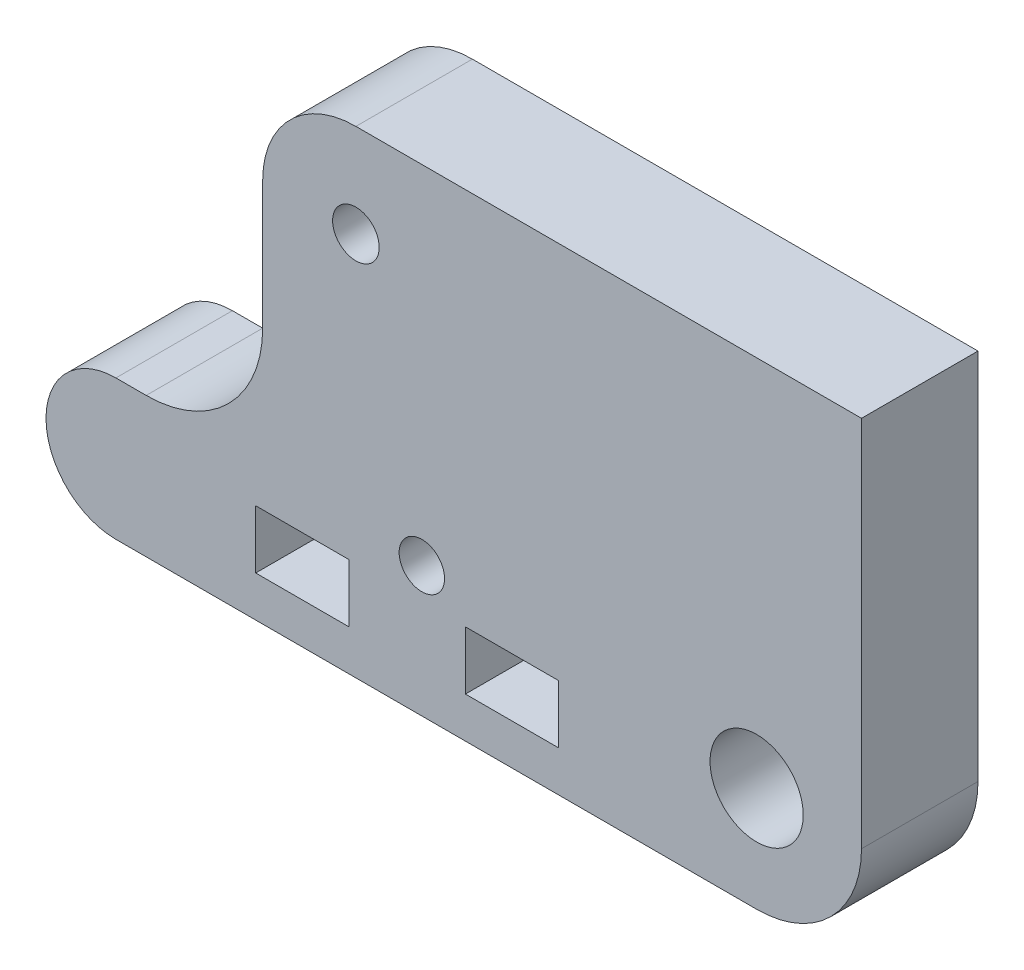
ISO-10303-21;
HEADER;
FILE_DESCRIPTION(('STEP AP214'),'2;1');
FILE_NAME('part.step','',(''),(''),'','','');
FILE_SCHEMA(('AUTOMOTIVE_DESIGN { 1 0 10303 214 1 1 1 1 }'));
ENDSEC;
DATA;
#1=APPLICATION_CONTEXT('core data for automotive mechanical design processes');
#2=APPLICATION_PROTOCOL_DEFINITION('international standard','automotive_design',2000,#1);
#3=PRODUCT_CONTEXT('',#1,'mechanical');
#4=PRODUCT('Part','Part','',(#3));
#5=PRODUCT_RELATED_PRODUCT_CATEGORY('part','',(#4));
#6=PRODUCT_DEFINITION_FORMATION('','',#4);
#7=PRODUCT_DEFINITION_CONTEXT('part definition',#1,'design');
#8=PRODUCT_DEFINITION('design','',#6,#7);
#9=PRODUCT_DEFINITION_SHAPE('','',#8);
#10=(LENGTH_UNIT() NAMED_UNIT(*) SI_UNIT(.MILLI.,.METRE.));
#11=(NAMED_UNIT(*) PLANE_ANGLE_UNIT() SI_UNIT($,.RADIAN.));
#12=(NAMED_UNIT(*) SI_UNIT($,.STERADIAN.) SOLID_ANGLE_UNIT());
#13=UNCERTAINTY_MEASURE_WITH_UNIT(LENGTH_MEASURE(1.E-05),#10,'distance_accuracy_value','');
#14=(GEOMETRIC_REPRESENTATION_CONTEXT(3) GLOBAL_UNCERTAINTY_ASSIGNED_CONTEXT((#13)) GLOBAL_UNIT_ASSIGNED_CONTEXT((#10,
#11,#12)) REPRESENTATION_CONTEXT('',''));
#15=CARTESIAN_POINT('',(0.,0.,0.));
#16=DIRECTION('',(0.,0.,1.));
#17=DIRECTION('',(1.,0.,0.));
#18=AXIS2_PLACEMENT_3D('',#15,#16,#17);
#19=CARTESIAN_POINT('',(0.,8.5,10.));
#20=DIRECTION('',(0.,1.,0.));
#21=DIRECTION('',(0.,0.,1.));
#22=AXIS2_PLACEMENT_3D('',#19,#20,#21);
#23=PLANE('',#22);
#24=DIRECTION('',(1.,0.,0.));
#25=VECTOR('',#24,1.);
#26=CARTESIAN_POINT('',(0.,8.5,0.));
#27=LINE('',#26,#25);
#28=CARTESIAN_POINT('',(2.5,8.5,0.));
#29=VERTEX_POINT('',#28);
#30=CARTESIAN_POINT('',(10.5,8.5,0.));
#31=VERTEX_POINT('',#30);
#32=EDGE_CURVE('E233',#29,#31,#27,.T.);
#33=ORIENTED_EDGE('',*,*,#32,.T.);
#34=DIRECTION('',(0.,0.,-1.));
#35=VECTOR('',#34,1.);
#36=CARTESIAN_POINT('',(10.5,8.5,10.));
#37=LINE('',#36,#35);
#38=CARTESIAN_POINT('',(10.5,8.5,10.));
#39=VERTEX_POINT('',#38);
#40=EDGE_CURVE('E11',#39,#31,#37,.T.);
#41=ORIENTED_EDGE('',*,*,#40,.F.);
#42=DIRECTION('',(1.,0.,0.));
#43=VECTOR('',#42,1.);
#44=CARTESIAN_POINT('',(0.,8.5,10.));
#45=LINE('',#44,#43);
#46=CARTESIAN_POINT('',(2.5,8.5,10.));
#47=VERTEX_POINT('',#46);
#48=EDGE_CURVE('E169',#47,#39,#45,.T.);
#49=ORIENTED_EDGE('',*,*,#48,.F.);
#50=DIRECTION('',(0.,0.,-1.));
#51=VECTOR('',#50,1.);
#52=CARTESIAN_POINT('',(2.5,8.5,10.));
#53=LINE('',#52,#51);
#54=EDGE_CURVE('E54',#47,#29,#53,.T.);
#55=ORIENTED_EDGE('',*,*,#54,.T.);
#56=EDGE_LOOP('',(#33,#41,#49,#55));
#57=FACE_BOUND('',#56,.T.);
#58=ADVANCED_FACE('F35',(#57),#23,.F.);
#59=CARTESIAN_POINT('',(10.5,0.,10.));
#60=DIRECTION('',(1.,0.,0.));
#61=DIRECTION('',(0.,0.,-1.));
#62=AXIS2_PLACEMENT_3D('',#59,#60,#61);
#63=PLANE('',#62);
#64=DIRECTION('',(0.,-1.,0.));
#65=VECTOR('',#64,1.);
#66=CARTESIAN_POINT('',(10.5,0.,0.));
#67=LINE('',#66,#65);
#68=CARTESIAN_POINT('',(10.5,3.5,0.));
#69=VERTEX_POINT('',#68);
#70=EDGE_CURVE('E175',#31,#69,#67,.T.);
#71=ORIENTED_EDGE('',*,*,#70,.T.);
#72=DIRECTION('',(0.,0.,-1.));
#73=VECTOR('',#72,1.);
#74=CARTESIAN_POINT('',(10.5,3.5,10.));
#75=LINE('',#74,#73);
#76=CARTESIAN_POINT('',(10.5,3.5,10.));
#77=VERTEX_POINT('',#76);
#78=EDGE_CURVE('E45',#77,#69,#75,.T.);
#79=ORIENTED_EDGE('',*,*,#78,.F.);
#80=DIRECTION('',(0.,-1.,0.));
#81=VECTOR('',#80,1.);
#82=CARTESIAN_POINT('',(10.5,0.,10.));
#83=LINE('',#82,#81);
#84=EDGE_CURVE('E163',#39,#77,#83,.T.);
#85=ORIENTED_EDGE('',*,*,#84,.F.);
#86=ORIENTED_EDGE('',*,*,#40,.T.);
#87=EDGE_LOOP('',(#71,#79,#85,#86));
#88=FACE_BOUND('',#87,.T.);
#89=ADVANCED_FACE('F174',(#88),#63,.F.);
#90=CARTESIAN_POINT('',(0.,3.5,10.));
#91=DIRECTION('',(0.,1.,0.));
#92=DIRECTION('',(0.,0.,1.));
#93=AXIS2_PLACEMENT_3D('',#90,#91,#92);
#94=PLANE('',#93);
#95=DIRECTION('',(1.,0.,0.));
#96=VECTOR('',#95,1.);
#97=CARTESIAN_POINT('',(0.,3.5,0.));
#98=LINE('',#97,#96);
#99=CARTESIAN_POINT('',(2.5,3.5,0.));
#100=VERTEX_POINT('',#99);
#101=EDGE_CURVE('E236',#100,#69,#98,.T.);
#102=ORIENTED_EDGE('',*,*,#101,.F.);
#103=DIRECTION('',(0.,0.,-1.));
#104=VECTOR('',#103,1.);
#105=CARTESIAN_POINT('',(2.5,3.5,10.));
#106=LINE('',#105,#104);
#107=CARTESIAN_POINT('',(2.5,3.5,10.));
#108=VERTEX_POINT('',#107);
#109=EDGE_CURVE('E107',#108,#100,#106,.T.);
#110=ORIENTED_EDGE('',*,*,#109,.F.);
#111=DIRECTION('',(1.,0.,0.));
#112=VECTOR('',#111,1.);
#113=CARTESIAN_POINT('',(0.,3.5,10.));
#114=LINE('',#113,#112);
#115=EDGE_CURVE('E168',#108,#77,#114,.T.);
#116=ORIENTED_EDGE('',*,*,#115,.T.);
#117=ORIENTED_EDGE('',*,*,#78,.T.);
#118=EDGE_LOOP('',(#102,#110,#116,#117));
#119=FACE_BOUND('',#118,.T.);
#120=ADVANCED_FACE('F179',(#119),#94,.T.);
#121=CARTESIAN_POINT('',(0.,8.5,10.));
#122=DIRECTION('',(0.,1.,0.));
#123=DIRECTION('',(0.,0.,1.));
#124=AXIS2_PLACEMENT_3D('',#121,#122,#123);
#125=PLANE('',#124);
#126=DIRECTION('',(1.,0.,0.));
#127=VECTOR('',#126,1.);
#128=CARTESIAN_POINT('',(0.,8.5,0.));
#129=LINE('',#128,#127);
#130=CARTESIAN_POINT('',(-15.5,8.5,0.));
#131=VERTEX_POINT('',#130);
#132=CARTESIAN_POINT('',(-7.5,8.5,0.));
#133=VERTEX_POINT('',#132);
#134=EDGE_CURVE('E221',#131,#133,#129,.T.);
#135=ORIENTED_EDGE('',*,*,#134,.T.);
#136=DIRECTION('',(0.,0.,-1.));
#137=VECTOR('',#136,1.);
#138=CARTESIAN_POINT('',(-7.5,8.5,10.));
#139=LINE('',#138,#137);
#140=CARTESIAN_POINT('',(-7.5,8.5,10.));
#141=VERTEX_POINT('',#140);
#142=EDGE_CURVE('E242',#141,#133,#139,.T.);
#143=ORIENTED_EDGE('',*,*,#142,.F.);
#144=DIRECTION('',(1.,0.,0.));
#145=VECTOR('',#144,1.);
#146=CARTESIAN_POINT('',(0.,8.5,10.));
#147=LINE('',#146,#145);
#148=CARTESIAN_POINT('',(-15.5,8.5,10.));
#149=VERTEX_POINT('',#148);
#150=EDGE_CURVE('E319',#149,#141,#147,.T.);
#151=ORIENTED_EDGE('',*,*,#150,.F.);
#152=DIRECTION('',(0.,0.,-1.));
#153=VECTOR('',#152,1.);
#154=CARTESIAN_POINT('',(-15.5,8.5,10.));
#155=LINE('',#154,#153);
#156=EDGE_CURVE('E244',#149,#131,#155,.T.);
#157=ORIENTED_EDGE('',*,*,#156,.T.);
#158=EDGE_LOOP('',(#135,#143,#151,#157));
#159=FACE_BOUND('',#158,.T.);
#160=ADVANCED_FACE('F345',(#159),#125,.F.);
#161=CARTESIAN_POINT('',(-7.5,0.,10.));
#162=DIRECTION('',(1.,0.,0.));
#163=DIRECTION('',(0.,0.,-1.));
#164=AXIS2_PLACEMENT_3D('',#161,#162,#163);
#165=PLANE('',#164);
#166=DIRECTION('',(0.,-1.,0.));
#167=VECTOR('',#166,1.);
#168=CARTESIAN_POINT('',(-7.5,0.,0.));
#169=LINE('',#168,#167);
#170=CARTESIAN_POINT('',(-7.5,3.5,0.));
#171=VERTEX_POINT('',#170);
#172=EDGE_CURVE('E224',#133,#171,#169,.T.);
#173=ORIENTED_EDGE('',*,*,#172,.T.);
#174=DIRECTION('',(0.,0.,-1.));
#175=VECTOR('',#174,1.);
#176=CARTESIAN_POINT('',(-7.5,3.5,10.));
#177=LINE('',#176,#175);
#178=CARTESIAN_POINT('',(-7.5,3.5,10.));
#179=VERTEX_POINT('',#178);
#180=EDGE_CURVE('E248',#179,#171,#177,.T.);
#181=ORIENTED_EDGE('',*,*,#180,.F.);
#182=DIRECTION('',(0.,-1.,0.));
#183=VECTOR('',#182,1.);
#184=CARTESIAN_POINT('',(-7.5,0.,10.));
#185=LINE('',#184,#183);
#186=EDGE_CURVE('E322',#141,#179,#185,.T.);
#187=ORIENTED_EDGE('',*,*,#186,.F.);
#188=ORIENTED_EDGE('',*,*,#142,.T.);
#189=EDGE_LOOP('',(#173,#181,#187,#188));
#190=FACE_BOUND('',#189,.T.);
#191=ADVANCED_FACE('F347',(#190),#165,.F.);
#192=CARTESIAN_POINT('',(0.,3.5,10.));
#193=DIRECTION('',(0.,1.,0.));
#194=DIRECTION('',(0.,0.,1.));
#195=AXIS2_PLACEMENT_3D('',#192,#193,#194);
#196=PLANE('',#195);
#197=DIRECTION('',(1.,0.,0.));
#198=VECTOR('',#197,1.);
#199=CARTESIAN_POINT('',(0.,3.5,0.));
#200=LINE('',#199,#198);
#201=CARTESIAN_POINT('',(-15.5,3.5,0.));
#202=VERTEX_POINT('',#201);
#203=EDGE_CURVE('E227',#202,#171,#200,.T.);
#204=ORIENTED_EDGE('',*,*,#203,.F.);
#205=DIRECTION('',(0.,0.,-1.));
#206=VECTOR('',#205,1.);
#207=CARTESIAN_POINT('',(-15.5,3.5,10.));
#208=LINE('',#207,#206);
#209=CARTESIAN_POINT('',(-15.5,3.5,10.));
#210=VERTEX_POINT('',#209);
#211=EDGE_CURVE('E246',#210,#202,#208,.T.);
#212=ORIENTED_EDGE('',*,*,#211,.F.);
#213=DIRECTION('',(1.,0.,0.));
#214=VECTOR('',#213,1.);
#215=CARTESIAN_POINT('',(0.,3.5,10.));
#216=LINE('',#215,#214);
#217=EDGE_CURVE('E324',#210,#179,#216,.T.);
#218=ORIENTED_EDGE('',*,*,#217,.T.);
#219=ORIENTED_EDGE('',*,*,#180,.T.);
#220=EDGE_LOOP('',(#204,#212,#218,#219));
#221=FACE_BOUND('',#220,.T.);
#222=ADVANCED_FACE('F340',(#221),#196,.T.);
#223=CARTESIAN_POINT('',(27.5,9.,10.));
#224=DIRECTION('',(0.,0.,-1.));
#225=DIRECTION('',(-1.,0.,0.));
#226=AXIS2_PLACEMENT_3D('',#223,#224,#225);
#227=CYLINDRICAL_SURFACE('',#226,9.);
#228=CARTESIAN_POINT('',(27.5,9.,0.));
#229=DIRECTION('',(0.,0.,1.));
#230=DIRECTION('',(1.,0.,0.));
#231=AXIS2_PLACEMENT_3D('',#228,#229,#230);
#232=CIRCLE('',#231,9.);
#233=CARTESIAN_POINT('',(27.5,0.,0.));
#234=VERTEX_POINT('',#233);
#235=CARTESIAN_POINT('',(36.5,9.,0.));
#236=VERTEX_POINT('',#235);
#237=EDGE_CURVE('E186',#234,#236,#232,.T.);
#238=ORIENTED_EDGE('',*,*,#237,.T.);
#239=DIRECTION('',(0.,0.,-1.));
#240=VECTOR('',#239,1.);
#241=CARTESIAN_POINT('',(36.5,9.,10.));
#242=LINE('',#241,#240);
#243=CARTESIAN_POINT('',(36.5,9.,10.));
#244=VERTEX_POINT('',#243);
#245=EDGE_CURVE('E39',#244,#236,#242,.T.);
#246=ORIENTED_EDGE('',*,*,#245,.F.);
#247=CARTESIAN_POINT('',(27.5,9.,10.));
#248=DIRECTION('',(0.,0.,1.));
#249=DIRECTION('',(1.,0.,0.));
#250=AXIS2_PLACEMENT_3D('',#247,#248,#249);
#251=CIRCLE('',#250,9.);
#252=CARTESIAN_POINT('',(27.5,0.,10.));
#253=VERTEX_POINT('',#252);
#254=EDGE_CURVE('E120',#253,#244,#251,.T.);
#255=ORIENTED_EDGE('',*,*,#254,.F.);
#256=DIRECTION('',(0.,0.,-1.));
#257=VECTOR('',#256,1.);
#258=CARTESIAN_POINT('',(27.5,0.,10.));
#259=LINE('',#258,#257);
#260=EDGE_CURVE('E182',#253,#234,#259,.T.);
#261=ORIENTED_EDGE('',*,*,#260,.T.);
#262=EDGE_LOOP('',(#238,#246,#255,#261));
#263=FACE_BOUND('',#262,.T.);
#264=ADVANCED_FACE('F37',(#263),#227,.T.);
#265=CARTESIAN_POINT('',(36.5,0.,10.));
#266=DIRECTION('',(1.,0.,0.));
#267=DIRECTION('',(0.,0.,-1.));
#268=AXIS2_PLACEMENT_3D('',#265,#266,#267);
#269=PLANE('',#268);
#270=DIRECTION('',(0.,-1.,0.));
#271=VECTOR('',#270,1.);
#272=CARTESIAN_POINT('',(36.5,0.,0.));
#273=LINE('',#272,#271);
#274=CARTESIAN_POINT('',(36.5,41.,0.));
#275=VERTEX_POINT('',#274);
#276=EDGE_CURVE('E189',#275,#236,#273,.T.);
#277=ORIENTED_EDGE('',*,*,#276,.F.);
#278=DIRECTION('',(0.,0.,-1.));
#279=VECTOR('',#278,1.);
#280=CARTESIAN_POINT('',(36.5,41.,10.));
#281=LINE('',#280,#279);
#282=CARTESIAN_POINT('',(36.5,41.,10.));
#283=VERTEX_POINT('',#282);
#284=EDGE_CURVE('E265',#283,#275,#281,.T.);
#285=ORIENTED_EDGE('',*,*,#284,.F.);
#286=DIRECTION('',(0.,-1.,0.));
#287=VECTOR('',#286,1.);
#288=CARTESIAN_POINT('',(36.5,0.,10.));
#289=LINE('',#288,#287);
#290=EDGE_CURVE('E273',#283,#244,#289,.T.);
#291=ORIENTED_EDGE('',*,*,#290,.T.);
#292=ORIENTED_EDGE('',*,*,#245,.T.);
#293=EDGE_LOOP('',(#277,#285,#291,#292));
#294=FACE_BOUND('',#293,.T.);
#295=ADVANCED_FACE('F272',(#294),#269,.T.);
#296=CARTESIAN_POINT('',(0.,41.,10.));
#297=DIRECTION('',(0.,1.,0.));
#298=DIRECTION('',(0.,0.,1.));
#299=AXIS2_PLACEMENT_3D('',#296,#297,#298);
#300=PLANE('',#299);
#301=DIRECTION('',(1.,0.,0.));
#302=VECTOR('',#301,1.);
#303=CARTESIAN_POINT('',(0.,41.,0.));
#304=LINE('',#303,#302);
#305=CARTESIAN_POINT('',(-6.9,41.,0.));
#306=VERTEX_POINT('',#305);
#307=EDGE_CURVE('E192',#306,#275,#304,.T.);
#308=ORIENTED_EDGE('',*,*,#307,.F.);
#309=DIRECTION('',(0.,0.,-1.));
#310=VECTOR('',#309,1.);
#311=CARTESIAN_POINT('',(-6.9,41.,10.));
#312=LINE('',#311,#310);
#313=CARTESIAN_POINT('',(-6.9,41.,10.));
#314=VERTEX_POINT('',#313);
#315=EDGE_CURVE('E264',#314,#306,#312,.T.);
#316=ORIENTED_EDGE('',*,*,#315,.F.);
#317=DIRECTION('',(1.,0.,0.));
#318=VECTOR('',#317,1.);
#319=CARTESIAN_POINT('',(0.,41.,10.));
#320=LINE('',#319,#318);
#321=EDGE_CURVE('E284',#314,#283,#320,.T.);
#322=ORIENTED_EDGE('',*,*,#321,.T.);
#323=ORIENTED_EDGE('',*,*,#284,.T.);
#324=EDGE_LOOP('',(#308,#316,#322,#323));
#325=FACE_BOUND('',#324,.T.);
#326=ADVANCED_FACE('F282',(#325),#300,.T.);
#327=CARTESIAN_POINT('',(-6.9,33.,10.));
#328=DIRECTION('',(0.,0.,-1.));
#329=DIRECTION('',(-1.,0.,0.));
#330=AXIS2_PLACEMENT_3D('',#327,#328,#329);
#331=CYLINDRICAL_SURFACE('',#330,8.);
#332=CARTESIAN_POINT('',(-6.9,33.,0.));
#333=DIRECTION('',(0.,0.,1.));
#334=DIRECTION('',(1.,0.,0.));
#335=AXIS2_PLACEMENT_3D('',#332,#333,#334);
#336=CIRCLE('',#335,8.);
#337=CARTESIAN_POINT('',(-14.9,33.,0.));
#338=VERTEX_POINT('',#337);
#339=EDGE_CURVE('E195',#338,#306,#336,.F.);
#340=ORIENTED_EDGE('',*,*,#339,.F.);
#341=DIRECTION('',(0.,0.,-1.));
#342=VECTOR('',#341,1.);
#343=CARTESIAN_POINT('',(-14.9,33.,10.));
#344=LINE('',#343,#342);
#345=CARTESIAN_POINT('',(-14.9,33.,10.));
#346=VERTEX_POINT('',#345);
#347=EDGE_CURVE('E262',#346,#338,#344,.T.);
#348=ORIENTED_EDGE('',*,*,#347,.F.);
#349=CARTESIAN_POINT('',(-6.9,33.,10.));
#350=DIRECTION('',(0.,0.,1.));
#351=DIRECTION('',(1.,0.,0.));
#352=AXIS2_PLACEMENT_3D('',#349,#350,#351);
#353=CIRCLE('',#352,8.);
#354=EDGE_CURVE('E290',#346,#314,#353,.F.);
#355=ORIENTED_EDGE('',*,*,#354,.T.);
#356=ORIENTED_EDGE('',*,*,#315,.T.);
#357=EDGE_LOOP('',(#340,#348,#355,#356));
#358=FACE_BOUND('',#357,.T.);
#359=ADVANCED_FACE('F293',(#358),#331,.T.);
#360=CARTESIAN_POINT('',(-14.9,0.,10.));
#361=DIRECTION('',(-1.,0.,0.));
#362=DIRECTION('',(0.,-1.,0.));
#363=AXIS2_PLACEMENT_3D('',#360,#361,#362);
#364=PLANE('',#363);
#365=DIRECTION('',(0.,1.,0.));
#366=VECTOR('',#365,1.);
#367=CARTESIAN_POINT('',(-14.9,0.,0.));
#368=LINE('',#367,#366);
#369=CARTESIAN_POINT('',(-14.9,22.0000000000001,0.));
#370=VERTEX_POINT('',#369);
#371=EDGE_CURVE('E198',#370,#338,#368,.T.);
#372=ORIENTED_EDGE('',*,*,#371,.F.);
#373=DIRECTION('',(0.,0.,-1.));
#374=VECTOR('',#373,1.);
#375=CARTESIAN_POINT('',(-14.9,22.0000000000001,10.));
#376=LINE('',#375,#374);
#377=CARTESIAN_POINT('',(-14.9,22.0000000000001,10.));
#378=VERTEX_POINT('',#377);
#379=EDGE_CURVE('E260',#378,#370,#376,.T.);
#380=ORIENTED_EDGE('',*,*,#379,.F.);
#381=DIRECTION('',(0.,1.,0.));
#382=VECTOR('',#381,1.);
#383=CARTESIAN_POINT('',(-14.9,0.,10.));
#384=LINE('',#383,#382);
#385=EDGE_CURVE('E294',#378,#346,#384,.T.);
#386=ORIENTED_EDGE('',*,*,#385,.T.);
#387=ORIENTED_EDGE('',*,*,#347,.T.);
#388=EDGE_LOOP('',(#372,#380,#386,#387));
#389=FACE_BOUND('',#388,.T.);
#390=ADVANCED_FACE('F390',(#389),#364,.T.);
#391=CARTESIAN_POINT('',(-24.9,22.,10.));
#392=DIRECTION('',(0.,0.,-1.));
#393=DIRECTION('',(-1.,0.,0.));
#394=AXIS2_PLACEMENT_3D('',#391,#392,#393);
#395=CYLINDRICAL_SURFACE('',#394,10.);
#396=CARTESIAN_POINT('',(-24.9,22.,0.));
#397=DIRECTION('',(0.,0.,1.));
#398=DIRECTION('',(1.,0.,0.));
#399=AXIS2_PLACEMENT_3D('',#396,#397,#398);
#400=CIRCLE('',#399,10.);
#401=CARTESIAN_POINT('',(-24.9000000000001,12.,0.));
#402=VERTEX_POINT('',#401);
#403=EDGE_CURVE('E201',#402,#370,#400,.T.);
#404=ORIENTED_EDGE('',*,*,#403,.F.);
#405=DIRECTION('',(0.,0.,-1.));
#406=VECTOR('',#405,1.);
#407=CARTESIAN_POINT('',(-24.9000000000001,12.,10.));
#408=LINE('',#407,#406);
#409=CARTESIAN_POINT('',(-24.9000000000001,12.,10.));
#410=VERTEX_POINT('',#409);
#411=EDGE_CURVE('E258',#410,#402,#408,.T.);
#412=ORIENTED_EDGE('',*,*,#411,.F.);
#413=CARTESIAN_POINT('',(-24.9,22.,10.));
#414=DIRECTION('',(0.,0.,1.));
#415=DIRECTION('',(1.,0.,0.));
#416=AXIS2_PLACEMENT_3D('',#413,#414,#415);
#417=CIRCLE('',#416,10.);
#418=EDGE_CURVE('E296',#410,#378,#417,.T.);
#419=ORIENTED_EDGE('',*,*,#418,.T.);
#420=ORIENTED_EDGE('',*,*,#379,.T.);
#421=EDGE_LOOP('',(#404,#412,#419,#420));
#422=FACE_BOUND('',#421,.T.);
#423=ADVANCED_FACE('F380',(#422),#395,.F.);
#424=CARTESIAN_POINT('',(0.,12.,10.));
#425=DIRECTION('',(0.,1.,0.));
#426=DIRECTION('',(0.,0.,1.));
#427=AXIS2_PLACEMENT_3D('',#424,#425,#426);
#428=PLANE('',#427);
#429=DIRECTION('',(1.,0.,0.));
#430=VECTOR('',#429,1.);
#431=CARTESIAN_POINT('',(0.,12.,0.));
#432=LINE('',#431,#430);
#433=CARTESIAN_POINT('',(-27.5,12.,0.));
#434=VERTEX_POINT('',#433);
#435=EDGE_CURVE('E204',#434,#402,#432,.T.);
#436=ORIENTED_EDGE('',*,*,#435,.F.);
#437=DIRECTION('',(0.,0.,-1.));
#438=VECTOR('',#437,1.);
#439=CARTESIAN_POINT('',(-27.5,12.,10.));
#440=LINE('',#439,#438);
#441=CARTESIAN_POINT('',(-27.5,12.,10.));
#442=VERTEX_POINT('',#441);
#443=EDGE_CURVE('E256',#442,#434,#440,.T.);
#444=ORIENTED_EDGE('',*,*,#443,.F.);
#445=DIRECTION('',(1.,0.,0.));
#446=VECTOR('',#445,1.);
#447=CARTESIAN_POINT('',(0.,12.,10.));
#448=LINE('',#447,#446);
#449=EDGE_CURVE('E302',#442,#410,#448,.T.);
#450=ORIENTED_EDGE('',*,*,#449,.T.);
#451=ORIENTED_EDGE('',*,*,#411,.T.);
#452=EDGE_LOOP('',(#436,#444,#450,#451));
#453=FACE_BOUND('',#452,.T.);
#454=ADVANCED_FACE('F374',(#453),#428,.T.);
#455=CARTESIAN_POINT('',(-27.5,6.,10.));
#456=DIRECTION('',(0.,0.,-1.));
#457=DIRECTION('',(-1.,0.,0.));
#458=AXIS2_PLACEMENT_3D('',#455,#456,#457);
#459=CYLINDRICAL_SURFACE('',#458,6.);
#460=CARTESIAN_POINT('',(-27.5,6.,0.));
#461=DIRECTION('',(0.,0.,1.));
#462=DIRECTION('',(1.,0.,0.));
#463=AXIS2_PLACEMENT_3D('',#460,#461,#462);
#464=CIRCLE('',#463,6.);
#465=CARTESIAN_POINT('',(-27.5,0.,0.));
#466=VERTEX_POINT('',#465);
#467=EDGE_CURVE('E207',#466,#434,#464,.F.);
#468=ORIENTED_EDGE('',*,*,#467,.F.);
#469=DIRECTION('',(0.,0.,-1.));
#470=VECTOR('',#469,1.);
#471=CARTESIAN_POINT('',(-27.5,0.,10.));
#472=LINE('',#471,#470);
#473=CARTESIAN_POINT('',(-27.5,0.,10.));
#474=VERTEX_POINT('',#473);
#475=EDGE_CURVE('E254',#474,#466,#472,.T.);
#476=ORIENTED_EDGE('',*,*,#475,.F.);
#477=CARTESIAN_POINT('',(-27.5,6.,10.));
#478=DIRECTION('',(0.,0.,1.));
#479=DIRECTION('',(1.,0.,0.));
#480=AXIS2_PLACEMENT_3D('',#477,#478,#479);
#481=CIRCLE('',#480,6.);
#482=EDGE_CURVE('E305',#474,#442,#481,.F.);
#483=ORIENTED_EDGE('',*,*,#482,.T.);
#484=ORIENTED_EDGE('',*,*,#443,.T.);
#485=EDGE_LOOP('',(#468,#476,#483,#484));
#486=FACE_BOUND('',#485,.T.);
#487=ADVANCED_FACE('F366',(#486),#459,.T.);
#488=CARTESIAN_POINT('',(-15.5,0.,10.));
#489=DIRECTION('',(1.,0.,0.));
#490=DIRECTION('',(0.,0.,-1.));
#491=AXIS2_PLACEMENT_3D('',#488,#489,#490);
#492=PLANE('',#491);
#493=DIRECTION('',(0.,-1.,0.));
#494=VECTOR('',#493,1.);
#495=CARTESIAN_POINT('',(-15.5,0.,0.));
#496=LINE('',#495,#494);
#497=EDGE_CURVE('E230',#131,#202,#496,.T.);
#498=ORIENTED_EDGE('',*,*,#497,.F.);
#499=ORIENTED_EDGE('',*,*,#156,.F.);
#500=DIRECTION('',(0.,-1.,0.));
#501=VECTOR('',#500,1.);
#502=CARTESIAN_POINT('',(-15.5,0.,10.));
#503=LINE('',#502,#501);
#504=EDGE_CURVE('E327',#149,#210,#503,.T.);
#505=ORIENTED_EDGE('',*,*,#504,.T.);
#506=ORIENTED_EDGE('',*,*,#211,.T.);
#507=EDGE_LOOP('',(#498,#499,#505,#506));
#508=FACE_BOUND('',#507,.T.);
#509=ADVANCED_FACE('F332',(#508),#492,.T.);
#510=CARTESIAN_POINT('',(27.5,9.,10.));
#511=DIRECTION('',(0.,0.,-1.));
#512=DIRECTION('',(-1.,0.,0.));
#513=AXIS2_PLACEMENT_3D('',#510,#511,#512);
#514=CYLINDRICAL_SURFACE('',#513,4.00000000000001);
#515=CARTESIAN_POINT('',(27.5,9.,10.));
#516=DIRECTION('',(0.,0.,1.));
#517=DIRECTION('',(1.,0.,0.));
#518=AXIS2_PLACEMENT_3D('',#515,#516,#517);
#519=CIRCLE('',#518,4.00000000000001);
#520=CARTESIAN_POINT('',(31.5,9.,10.));
#521=VERTEX_POINT('',#520);
#522=EDGE_CURVE('E316',#521,#521,#519,.T.);
#523=ORIENTED_EDGE('',*,*,#522,.T.);
#524=EDGE_LOOP('',(#523));
#525=FACE_BOUND('',#524,.T.);
#526=CARTESIAN_POINT('',(27.5,9.,0.));
#527=DIRECTION('',(0.,0.,1.));
#528=DIRECTION('',(1.,0.,0.));
#529=AXIS2_PLACEMENT_3D('',#526,#527,#528);
#530=CIRCLE('',#529,4.00000000000001);
#531=CARTESIAN_POINT('',(31.5,9.,0.));
#532=VERTEX_POINT('',#531);
#533=EDGE_CURVE('E218',#532,#532,#530,.T.);
#534=ORIENTED_EDGE('',*,*,#533,.F.);
#535=EDGE_LOOP('',(#534));
#536=FACE_BOUND('',#535,.T.);
#537=ADVANCED_FACE('F365',(#525,#536),#514,.F.);
#538=CARTESIAN_POINT('',(-6.9,33.,10.));
#539=DIRECTION('',(0.,0.,-1.));
#540=DIRECTION('',(-1.,0.,0.));
#541=AXIS2_PLACEMENT_3D('',#538,#539,#540);
#542=CYLINDRICAL_SURFACE('',#541,2.);
#543=CARTESIAN_POINT('',(-6.9,33.,10.));
#544=DIRECTION('',(0.,0.,1.));
#545=DIRECTION('',(1.,0.,0.));
#546=AXIS2_PLACEMENT_3D('',#543,#544,#545);
#547=CIRCLE('',#546,2.);
#548=CARTESIAN_POINT('',(-4.9,33.,10.));
#549=VERTEX_POINT('',#548);
#550=EDGE_CURVE('E313',#549,#549,#547,.T.);
#551=ORIENTED_EDGE('',*,*,#550,.T.);
#552=EDGE_LOOP('',(#551));
#553=FACE_BOUND('',#552,.T.);
#554=CARTESIAN_POINT('',(-6.9,33.,0.));
#555=DIRECTION('',(0.,0.,1.));
#556=DIRECTION('',(1.,0.,0.));
#557=AXIS2_PLACEMENT_3D('',#554,#555,#556);
#558=CIRCLE('',#557,2.);
#559=CARTESIAN_POINT('',(-4.9,33.,0.));
#560=VERTEX_POINT('',#559);
#561=EDGE_CURVE('E215',#560,#560,#558,.T.);
#562=ORIENTED_EDGE('',*,*,#561,.F.);
#563=EDGE_LOOP('',(#562));
#564=FACE_BOUND('',#563,.T.);
#565=ADVANCED_FACE('F371',(#553,#564),#542,.F.);
#566=CARTESIAN_POINT('',(-1.23817175246918,11.1832946300741,10.));
#567=DIRECTION('',(0.,0.,-1.));
#568=DIRECTION('',(-1.,0.,0.));
#569=AXIS2_PLACEMENT_3D('',#566,#567,#568);
#570=CYLINDRICAL_SURFACE('',#569,1.94999999938472);
#571=CARTESIAN_POINT('',(-1.23817175246918,11.1832946300741,10.));
#572=DIRECTION('',(0.,0.,1.));
#573=DIRECTION('',(1.,0.,0.));
#574=AXIS2_PLACEMENT_3D('',#571,#572,#573);
#575=CIRCLE('',#574,1.94999999938472);
#576=CARTESIAN_POINT('',(0.711828246915535,11.1832946300741,10.));
#577=VERTEX_POINT('',#576);
#578=EDGE_CURVE('E310',#577,#577,#575,.T.);
#579=ORIENTED_EDGE('',*,*,#578,.T.);
#580=EDGE_LOOP('',(#579));
#581=FACE_BOUND('',#580,.T.);
#582=CARTESIAN_POINT('',(-1.23817175246918,11.1832946300741,0.));
#583=DIRECTION('',(0.,0.,1.));
#584=DIRECTION('',(1.,0.,0.));
#585=AXIS2_PLACEMENT_3D('',#582,#583,#584);
#586=CIRCLE('',#585,1.94999999938472);
#587=CARTESIAN_POINT('',(0.711828246915535,11.1832946300741,0.));
#588=VERTEX_POINT('',#587);
#589=EDGE_CURVE('E212',#588,#588,#586,.T.);
#590=ORIENTED_EDGE('',*,*,#589,.F.);
#591=EDGE_LOOP('',(#590));
#592=FACE_BOUND('',#591,.T.);
#593=ADVANCED_FACE('F476',(#581,#592),#570,.F.);
#594=CARTESIAN_POINT('',(0.,0.,10.));
#595=DIRECTION('',(0.,1.,0.));
#596=DIRECTION('',(0.,0.,1.));
#597=AXIS2_PLACEMENT_3D('',#594,#595,#596);
#598=PLANE('',#597);
#599=DIRECTION('',(1.,0.,0.));
#600=VECTOR('',#599,1.);
#601=CARTESIAN_POINT('',(0.,0.,0.));
#602=LINE('',#601,#600);
#603=EDGE_CURVE('E210',#466,#234,#602,.T.);
#604=ORIENTED_EDGE('',*,*,#603,.T.);
#605=ORIENTED_EDGE('',*,*,#260,.F.);
#606=DIRECTION('',(1.,0.,0.));
#607=VECTOR('',#606,1.);
#608=CARTESIAN_POINT('',(0.,0.,10.));
#609=LINE('',#608,#607);
#610=EDGE_CURVE('E308',#474,#253,#609,.T.);
#611=ORIENTED_EDGE('',*,*,#610,.F.);
#612=ORIENTED_EDGE('',*,*,#475,.T.);
#613=EDGE_LOOP('',(#604,#605,#611,#612));
#614=FACE_BOUND('',#613,.T.);
#615=ADVANCED_FACE('F385',(#614),#598,.F.);
#616=CARTESIAN_POINT('',(2.5,0.,10.));
#617=DIRECTION('',(1.,0.,0.));
#618=DIRECTION('',(0.,0.,-1.));
#619=AXIS2_PLACEMENT_3D('',#616,#617,#618);
#620=PLANE('',#619);
#621=DIRECTION('',(0.,-1.,0.));
#622=VECTOR('',#621,1.);
#623=CARTESIAN_POINT('',(2.5,0.,0.));
#624=LINE('',#623,#622);
#625=EDGE_CURVE('E238',#29,#100,#624,.T.);
#626=ORIENTED_EDGE('',*,*,#625,.F.);
#627=ORIENTED_EDGE('',*,*,#54,.F.);
#628=DIRECTION('',(0.,-1.,0.));
#629=VECTOR('',#628,1.);
#630=CARTESIAN_POINT('',(2.5,0.,10.));
#631=LINE('',#630,#629);
#632=EDGE_CURVE('E180',#47,#108,#631,.T.);
#633=ORIENTED_EDGE('',*,*,#632,.T.);
#634=ORIENTED_EDGE('',*,*,#109,.T.);
#635=EDGE_LOOP('',(#626,#627,#633,#634));
#636=FACE_BOUND('',#635,.T.);
#637=ADVANCED_FACE('F440',(#636),#620,.T.);
#638=CARTESIAN_POINT('',(0.,0.,10.));
#639=DIRECTION('',(0.,0.,1.));
#640=DIRECTION('',(1.,0.,0.));
#641=AXIS2_PLACEMENT_3D('',#638,#639,#640);
#642=PLANE('',#641);
#643=ORIENTED_EDGE('',*,*,#254,.T.);
#644=ORIENTED_EDGE('',*,*,#290,.F.);
#645=ORIENTED_EDGE('',*,*,#321,.F.);
#646=ORIENTED_EDGE('',*,*,#354,.F.);
#647=ORIENTED_EDGE('',*,*,#385,.F.);
#648=ORIENTED_EDGE('',*,*,#418,.F.);
#649=ORIENTED_EDGE('',*,*,#449,.F.);
#650=ORIENTED_EDGE('',*,*,#482,.F.);
#651=ORIENTED_EDGE('',*,*,#610,.T.);
#652=EDGE_LOOP('',(#643,#644,#645,#646,#647,#648,#649,#650,#651));
#653=FACE_BOUND('',#652,.T.);
#654=ORIENTED_EDGE('',*,*,#578,.F.);
#655=EDGE_LOOP('',(#654));
#656=FACE_BOUND('',#655,.T.);
#657=ORIENTED_EDGE('',*,*,#550,.F.);
#658=EDGE_LOOP('',(#657));
#659=FACE_BOUND('',#658,.T.);
#660=ORIENTED_EDGE('',*,*,#522,.F.);
#661=EDGE_LOOP('',(#660));
#662=FACE_BOUND('',#661,.T.);
#663=ORIENTED_EDGE('',*,*,#150,.T.);
#664=ORIENTED_EDGE('',*,*,#186,.T.);
#665=ORIENTED_EDGE('',*,*,#217,.F.);
#666=ORIENTED_EDGE('',*,*,#504,.F.);
#667=EDGE_LOOP('',(#663,#664,#665,#666));
#668=FACE_BOUND('',#667,.T.);
#669=ORIENTED_EDGE('',*,*,#48,.T.);
#670=ORIENTED_EDGE('',*,*,#84,.T.);
#671=ORIENTED_EDGE('',*,*,#115,.F.);
#672=ORIENTED_EDGE('',*,*,#632,.F.);
#673=EDGE_LOOP('',(#669,#670,#671,#672));
#674=FACE_BOUND('',#673,.T.);
#675=ADVANCED_FACE('F165',(#653,#656,#659,#662,#668,#674),#642,.T.);
#676=CARTESIAN_POINT('',(0.,0.,0.));
#677=DIRECTION('',(0.,0.,1.));
#678=DIRECTION('',(1.,0.,0.));
#679=AXIS2_PLACEMENT_3D('',#676,#677,#678);
#680=PLANE('',#679);
#681=ORIENTED_EDGE('',*,*,#237,.F.);
#682=ORIENTED_EDGE('',*,*,#603,.F.);
#683=ORIENTED_EDGE('',*,*,#467,.T.);
#684=ORIENTED_EDGE('',*,*,#435,.T.);
#685=ORIENTED_EDGE('',*,*,#403,.T.);
#686=ORIENTED_EDGE('',*,*,#371,.T.);
#687=ORIENTED_EDGE('',*,*,#339,.T.);
#688=ORIENTED_EDGE('',*,*,#307,.T.);
#689=ORIENTED_EDGE('',*,*,#276,.T.);
#690=EDGE_LOOP('',(#681,#682,#683,#684,#685,#686,#687,#688,#689));
#691=FACE_BOUND('',#690,.T.);
#692=ORIENTED_EDGE('',*,*,#589,.T.);
#693=EDGE_LOOP('',(#692));
#694=FACE_BOUND('',#693,.T.);
#695=ORIENTED_EDGE('',*,*,#561,.T.);
#696=EDGE_LOOP('',(#695));
#697=FACE_BOUND('',#696,.T.);
#698=ORIENTED_EDGE('',*,*,#533,.T.);
#699=EDGE_LOOP('',(#698));
#700=FACE_BOUND('',#699,.T.);
#701=ORIENTED_EDGE('',*,*,#134,.F.);
#702=ORIENTED_EDGE('',*,*,#497,.T.);
#703=ORIENTED_EDGE('',*,*,#203,.T.);
#704=ORIENTED_EDGE('',*,*,#172,.F.);
#705=EDGE_LOOP('',(#701,#702,#703,#704));
#706=FACE_BOUND('',#705,.T.);
#707=ORIENTED_EDGE('',*,*,#32,.F.);
#708=ORIENTED_EDGE('',*,*,#625,.T.);
#709=ORIENTED_EDGE('',*,*,#101,.T.);
#710=ORIENTED_EDGE('',*,*,#70,.F.);
#711=EDGE_LOOP('',(#707,#708,#709,#710));
#712=FACE_BOUND('',#711,.T.);
#713=ADVANCED_FACE('F279',(#691,#694,#697,#700,#706,#712),#680,.F.);
#714=CLOSED_SHELL('',(#58,#89,#120,#160,#191,#222,#264,#295,#326,#359,#390,#423,#454,#487,#509,
#537,#565,#593,#615,#637,#675,#713));
#715=MANIFOLD_SOLID_BREP('B2',#714);
#716=ADVANCED_BREP_SHAPE_REPRESENTATION('',(#18,#715),#14);
#717=SHAPE_DEFINITION_REPRESENTATION(#9,#716);
ENDSEC;
END-ISO-10303-21;
